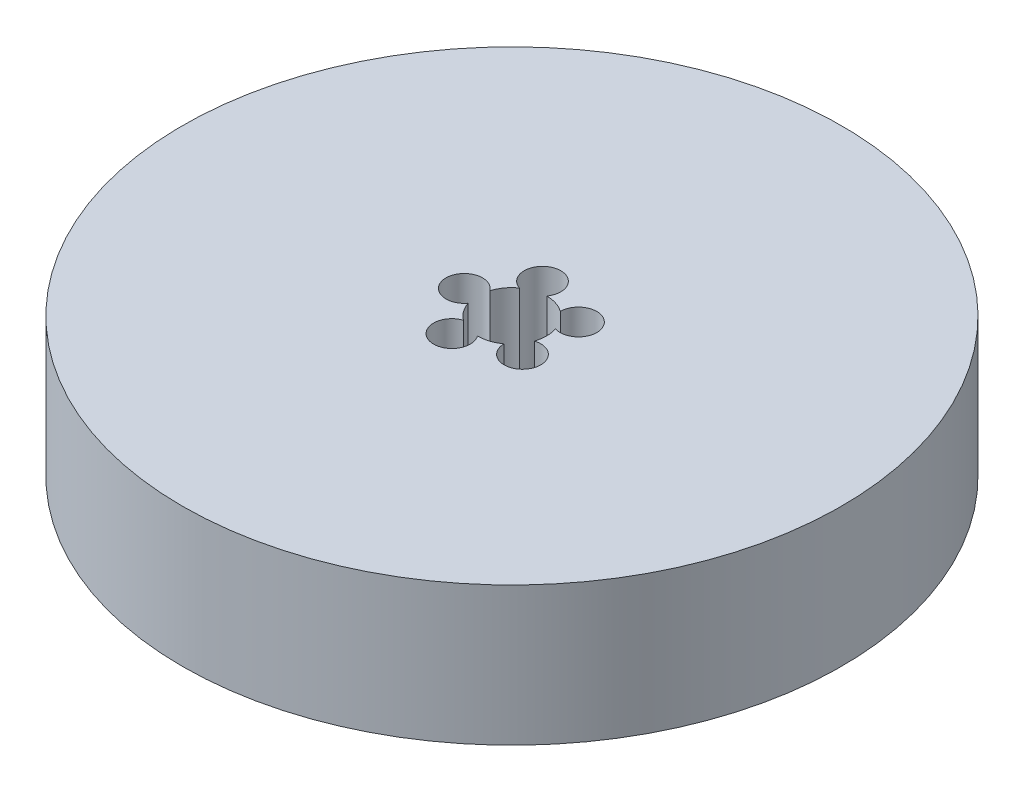
ISO-10303-21;
HEADER;
FILE_DESCRIPTION(('STEP AP214'),'2;1');
FILE_NAME('part.step','',(''),(''),'','','');
FILE_SCHEMA(('AUTOMOTIVE_DESIGN { 1 0 10303 214 1 1 1 1 }'));
ENDSEC;
DATA;
#1=APPLICATION_CONTEXT('core data for automotive mechanical design processes');
#2=APPLICATION_PROTOCOL_DEFINITION('international standard','automotive_design',2000,#1);
#3=PRODUCT_CONTEXT('',#1,'mechanical');
#4=PRODUCT('Part','Part','',(#3));
#5=PRODUCT_RELATED_PRODUCT_CATEGORY('part','',(#4));
#6=PRODUCT_DEFINITION_FORMATION('','',#4);
#7=PRODUCT_DEFINITION_CONTEXT('part definition',#1,'design');
#8=PRODUCT_DEFINITION('design','',#6,#7);
#9=PRODUCT_DEFINITION_SHAPE('','',#8);
#10=(LENGTH_UNIT() NAMED_UNIT(*) SI_UNIT(.MILLI.,.METRE.));
#11=(NAMED_UNIT(*) PLANE_ANGLE_UNIT() SI_UNIT($,.RADIAN.));
#12=(NAMED_UNIT(*) SI_UNIT($,.STERADIAN.) SOLID_ANGLE_UNIT());
#13=UNCERTAINTY_MEASURE_WITH_UNIT(LENGTH_MEASURE(1.E-05),#10,'distance_accuracy_value','');
#14=(GEOMETRIC_REPRESENTATION_CONTEXT(3) GLOBAL_UNCERTAINTY_ASSIGNED_CONTEXT((#13)) GLOBAL_UNIT_ASSIGNED_CONTEXT((#10,
#11,#12)) REPRESENTATION_CONTEXT('',''));
#15=CARTESIAN_POINT('',(0.,0.,0.));
#16=DIRECTION('',(0.,0.,1.));
#17=DIRECTION('',(1.,0.,0.));
#18=AXIS2_PLACEMENT_3D('',#15,#16,#17);
#19=CARTESIAN_POINT('',(0.,20.,0.));
#20=DIRECTION('',(0.,-1.,0.));
#21=DIRECTION('',(0.,0.,-1.));
#22=AXIS2_PLACEMENT_3D('',#19,#20,#21);
#23=CYLINDRICAL_SURFACE('',#22,47.5);
#24=CARTESIAN_POINT('',(0.,20.,0.));
#25=DIRECTION('',(0.,1.,0.));
#26=DIRECTION('',(0.,0.,1.));
#27=AXIS2_PLACEMENT_3D('',#24,#25,#26);
#28=CIRCLE('',#27,47.5);
#29=CARTESIAN_POINT('',(0.,20.,47.5));
#30=VERTEX_POINT('',#29);
#31=EDGE_CURVE('E157',#30,#30,#28,.T.);
#32=ORIENTED_EDGE('',*,*,#31,.F.);
#33=EDGE_LOOP('',(#32));
#34=FACE_BOUND('',#33,.T.);
#35=CARTESIAN_POINT('',(0.,0.,0.));
#36=DIRECTION('',(0.,1.,0.));
#37=DIRECTION('',(0.,0.,1.));
#38=AXIS2_PLACEMENT_3D('',#35,#36,#37);
#39=CIRCLE('',#38,47.5);
#40=CARTESIAN_POINT('',(0.,0.,47.5));
#41=VERTEX_POINT('',#40);
#42=EDGE_CURVE('E150',#41,#41,#39,.T.);
#43=ORIENTED_EDGE('',*,*,#42,.T.);
#44=EDGE_LOOP('',(#43));
#45=FACE_BOUND('',#44,.T.);
#46=ADVANCED_FACE('F39',(#34,#45),#23,.T.);
#47=CARTESIAN_POINT('',(0.,20.,0.));
#48=DIRECTION('',(0.,1.,0.));
#49=DIRECTION('',(0.,0.,1.));
#50=AXIS2_PLACEMENT_3D('',#47,#48,#49);
#51=PLANE('',#50);
#52=CARTESIAN_POINT('',(-2.12147698587407,20.,-6.52923479392056));
#53=DIRECTION('',(0.,1.,0.));
#54=DIRECTION('',(-0.95105651629515,0.,0.309016994374958));
#55=AXIS2_PLACEMENT_3D('',#52,#53,#54);
#56=CIRCLE('',#55,2.63897074803025);
#57=CARTESIAN_POINT('',(0.0291850133280784,20.,-4.99991482277419));
#58=VERTEX_POINT('',#57);
#59=CARTESIAN_POINT('',(-2.96248736730877,20.,-4.02786154162925));
#60=VERTEX_POINT('',#59);
#61=EDGE_CURVE('E194',#58,#60,#56,.T.);
#62=ORIENTED_EDGE('',*,*,#61,.F.);
#63=CARTESIAN_POINT('',(0.,20.,0.));
#64=DIRECTION('',(0.,1.,0.));
#65=DIRECTION('',(0.,0.,1.));
#66=AXIS2_PLACEMENT_3D('',#63,#64,#65);
#67=CIRCLE('',#66,5.);
#68=CARTESIAN_POINT('',(2.91526502378165,20.,-4.06217058247378));
#69=VERTEX_POINT('',#68);
#70=EDGE_CURVE('E147',#69,#58,#67,.T.);
#71=ORIENTED_EDGE('',*,*,#70,.F.);
#72=CARTESIAN_POINT('',(5.55409885536877,20.,-4.03528902317138));
#73=DIRECTION('',(0.,1.,0.));
#74=DIRECTION('',(-0.58778525229248,0.,-0.809016994374942));
#75=AXIS2_PLACEMENT_3D('',#72,#73,#74);
#76=CIRCLE('',#75,2.63897074803025);
#77=CARTESIAN_POINT('',(4.76422023821956,20.,-1.51730205356059));
#78=VERTEX_POINT('',#77);
#79=EDGE_CURVE('E254',#78,#69,#76,.T.);
#80=ORIENTED_EDGE('',*,*,#79,.F.);
#81=CARTESIAN_POINT('',(4.76422023821958,20.,1.51730205356052));
#82=VERTEX_POINT('',#81);
#83=EDGE_CURVE('E144',#82,#78,#67,.T.);
#84=ORIENTED_EDGE('',*,*,#83,.F.);
#85=CARTESIAN_POINT('',(5.55409885536883,20.,4.0352890231713));
#86=DIRECTION('',(0.,1.,0.));
#87=DIRECTION('',(0.587785252292469,0.,-0.809016994374951));
#88=AXIS2_PLACEMENT_3D('',#85,#86,#87);
#89=CIRCLE('',#88,2.63897074803025);
#90=CARTESIAN_POINT('',(2.9152650237817,20.,4.06217058247374));
#91=VERTEX_POINT('',#90);
#92=EDGE_CURVE('E141',#91,#82,#89,.T.);
#93=ORIENTED_EDGE('',*,*,#92,.F.);
#94=CARTESIAN_POINT('',(0.0291850133281478,20.,4.99991482277419));
#95=VERTEX_POINT('',#94);
#96=EDGE_CURVE('E134',#95,#91,#67,.T.);
#97=ORIENTED_EDGE('',*,*,#96,.F.);
#98=CARTESIAN_POINT('',(-2.12147698587398,20.,6.52923479392059));
#99=DIRECTION('',(0.,1.,0.));
#100=DIRECTION('',(0.951056516295155,0.,0.309016994374945));
#101=AXIS2_PLACEMENT_3D('',#98,#99,#100);
#102=CIRCLE('',#101,2.63897074803025);
#103=CARTESIAN_POINT('',(-2.96248736730871,20.,4.02786154162929));
#104=VERTEX_POINT('',#103);
#105=EDGE_CURVE('E111',#104,#95,#102,.T.);
#106=ORIENTED_EDGE('',*,*,#105,.F.);
#107=CARTESIAN_POINT('',(-4.74618290802067,20.,1.57281524776831));
#108=VERTEX_POINT('',#107);
#109=EDGE_CURVE('E145',#108,#104,#67,.T.);
#110=ORIENTED_EDGE('',*,*,#109,.F.);
#111=CARTESIAN_POINT('',(-6.86524373898962,20.,0.));
#112=DIRECTION('',(0.,1.,0.));
#113=DIRECTION('',(0.,0.,1.));
#114=AXIS2_PLACEMENT_3D('',#111,#112,#113);
#115=CIRCLE('',#114,2.63897074803025);
#116=CARTESIAN_POINT('',(-4.74618290802067,20.,-1.57281524776831));
#117=VERTEX_POINT('',#116);
#118=EDGE_CURVE('E153',#117,#108,#115,.T.);
#119=ORIENTED_EDGE('',*,*,#118,.F.);
#120=EDGE_CURVE('E146',#60,#117,#67,.T.);
#121=ORIENTED_EDGE('',*,*,#120,.F.);
#122=EDGE_LOOP('',(#62,#71,#80,#84,#93,#97,#106,#110,#119,#121));
#123=FACE_BOUND('',#122,.T.);
#124=ORIENTED_EDGE('',*,*,#31,.T.);
#125=EDGE_LOOP('',(#124));
#126=FACE_BOUND('',#125,.T.);
#127=ADVANCED_FACE('F139',(#123,#126),#51,.T.);
#128=CARTESIAN_POINT('',(0.,0.,0.));
#129=DIRECTION('',(0.,1.,0.));
#130=DIRECTION('',(0.,0.,1.));
#131=AXIS2_PLACEMENT_3D('',#128,#129,#130);
#132=PLANE('',#131);
#133=CARTESIAN_POINT('',(0.,0.,0.));
#134=DIRECTION('',(0.,1.,0.));
#135=DIRECTION('',(0.,0.,1.));
#136=AXIS2_PLACEMENT_3D('',#133,#134,#135);
#137=CIRCLE('',#136,5.);
#138=CARTESIAN_POINT('',(0.,0.,5.));
#139=VERTEX_POINT('',#138);
#140=EDGE_CURVE('E154',#139,#139,#137,.T.);
#141=ORIENTED_EDGE('',*,*,#140,.T.);
#142=EDGE_LOOP('',(#141));
#143=FACE_BOUND('',#142,.T.);
#144=ORIENTED_EDGE('',*,*,#42,.F.);
#145=EDGE_LOOP('',(#144));
#146=FACE_BOUND('',#145,.T.);
#147=ADVANCED_FACE('F213',(#143,#146),#132,.F.);
#148=CARTESIAN_POINT('',(0.,20.,0.));
#149=DIRECTION('',(0.,-1.,0.));
#150=DIRECTION('',(0.,0.,-1.));
#151=AXIS2_PLACEMENT_3D('',#148,#149,#150);
#152=CYLINDRICAL_SURFACE('',#151,5.);
#153=DIRECTION('',(0.,1.,0.));
#154=VECTOR('',#153,1.);
#155=CARTESIAN_POINT('',(0.0291850133280779,12.1211889570614,-4.99991482277419));
#156=LINE('',#155,#154);
#157=CARTESIAN_POINT('',(0.0291850133280784,4.24237791412272,-4.99991482277419));
#158=VERTEX_POINT('',#157);
#159=EDGE_CURVE('E11',#158,#58,#156,.T.);
#160=ORIENTED_EDGE('',*,*,#159,.F.);
#161=CARTESIAN_POINT('',(0.,4.24237791412272,0.));
#162=DIRECTION('',(0.,1.,0.));
#163=DIRECTION('',(0.,0.,1.));
#164=AXIS2_PLACEMENT_3D('',#161,#162,#163);
#165=CIRCLE('',#164,5.);
#166=CARTESIAN_POINT('',(-2.96248736730877,4.24237791412272,-4.02786154162925));
#167=VERTEX_POINT('',#166);
#168=EDGE_CURVE('E189',#158,#167,#165,.T.);
#169=ORIENTED_EDGE('',*,*,#168,.T.);
#170=DIRECTION('',(0.,1.,0.));
#171=VECTOR('',#170,1.);
#172=CARTESIAN_POINT('',(-2.96248736730877,12.1211889570614,-4.02786154162925));
#173=LINE('',#172,#171);
#174=EDGE_CURVE('E46',#60,#167,#173,.F.);
#175=ORIENTED_EDGE('',*,*,#174,.F.);
#176=ORIENTED_EDGE('',*,*,#120,.T.);
#177=DIRECTION('',(0.,1.,0.));
#178=VECTOR('',#177,1.);
#179=CARTESIAN_POINT('',(-4.74618290802067,12.1211889570614,-1.57281524776831));
#180=LINE('',#179,#178);
#181=CARTESIAN_POINT('',(-4.74618290802067,4.24237791412272,-1.57281524776831));
#182=VERTEX_POINT('',#181);
#183=EDGE_CURVE('E168',#182,#117,#180,.T.);
#184=ORIENTED_EDGE('',*,*,#183,.F.);
#185=CARTESIAN_POINT('',(0.,4.24237791412272,0.));
#186=DIRECTION('',(0.,1.,0.));
#187=DIRECTION('',(0.,0.,1.));
#188=AXIS2_PLACEMENT_3D('',#185,#186,#187);
#189=CIRCLE('',#188,5.);
#190=CARTESIAN_POINT('',(-4.74618290802067,4.24237791412272,1.57281524776831));
#191=VERTEX_POINT('',#190);
#192=EDGE_CURVE('E165',#182,#191,#189,.T.);
#193=ORIENTED_EDGE('',*,*,#192,.T.);
#194=DIRECTION('',(0.,1.,0.));
#195=VECTOR('',#194,1.);
#196=CARTESIAN_POINT('',(-4.74618290802067,12.1211889570614,1.57281524776831));
#197=LINE('',#196,#195);
#198=EDGE_CURVE('E170',#108,#191,#197,.F.);
#199=ORIENTED_EDGE('',*,*,#198,.F.);
#200=ORIENTED_EDGE('',*,*,#109,.T.);
#201=DIRECTION('',(0.,1.,0.));
#202=VECTOR('',#201,1.);
#203=CARTESIAN_POINT('',(-2.96248736730871,12.1211889570614,4.02786154162929));
#204=LINE('',#203,#202);
#205=CARTESIAN_POINT('',(-2.96248736730871,4.24237791412272,4.02786154162929));
#206=VERTEX_POINT('',#205);
#207=EDGE_CURVE('E121',#206,#104,#204,.T.);
#208=ORIENTED_EDGE('',*,*,#207,.F.);
#209=CARTESIAN_POINT('',(0.,4.24237791412272,0.));
#210=DIRECTION('',(0.,1.,0.));
#211=DIRECTION('',(0.,0.,1.));
#212=AXIS2_PLACEMENT_3D('',#209,#210,#211);
#213=CIRCLE('',#212,5.);
#214=CARTESIAN_POINT('',(0.0291850133281478,4.24237791412272,4.99991482277419));
#215=VERTEX_POINT('',#214);
#216=EDGE_CURVE('E136',#206,#215,#213,.T.);
#217=ORIENTED_EDGE('',*,*,#216,.T.);
#218=DIRECTION('',(0.,1.,0.));
#219=VECTOR('',#218,1.);
#220=CARTESIAN_POINT('',(0.0291850133281469,12.1211889570614,4.99991482277419));
#221=LINE('',#220,#219);
#222=EDGE_CURVE('E117',#95,#215,#221,.F.);
#223=ORIENTED_EDGE('',*,*,#222,.F.);
#224=ORIENTED_EDGE('',*,*,#96,.T.);
#225=DIRECTION('',(0.,1.,0.));
#226=VECTOR('',#225,1.);
#227=CARTESIAN_POINT('',(2.9152650237817,12.1211889570614,4.06217058247374));
#228=LINE('',#227,#226);
#229=CARTESIAN_POINT('',(2.9152650237817,4.24237791412272,4.06217058247374));
#230=VERTEX_POINT('',#229);
#231=EDGE_CURVE('E182',#230,#91,#228,.T.);
#232=ORIENTED_EDGE('',*,*,#231,.F.);
#233=CARTESIAN_POINT('',(0.,4.24237791412272,0.));
#234=DIRECTION('',(0.,1.,0.));
#235=DIRECTION('',(0.,0.,1.));
#236=AXIS2_PLACEMENT_3D('',#233,#234,#235);
#237=CIRCLE('',#236,5.);
#238=CARTESIAN_POINT('',(4.76422023821958,4.24237791412272,1.51730205356052));
#239=VERTEX_POINT('',#238);
#240=EDGE_CURVE('E174',#230,#239,#237,.T.);
#241=ORIENTED_EDGE('',*,*,#240,.T.);
#242=DIRECTION('',(0.,1.,0.));
#243=VECTOR('',#242,1.);
#244=CARTESIAN_POINT('',(4.76422023821958,12.1211889570614,1.51730205356052));
#245=LINE('',#244,#243);
#246=EDGE_CURVE('E177',#82,#239,#245,.F.);
#247=ORIENTED_EDGE('',*,*,#246,.F.);
#248=ORIENTED_EDGE('',*,*,#83,.T.);
#249=DIRECTION('',(0.,1.,0.));
#250=VECTOR('',#249,1.);
#251=CARTESIAN_POINT('',(4.76422023821956,12.1211889570614,-1.51730205356059));
#252=LINE('',#251,#250);
#253=CARTESIAN_POINT('',(4.76422023821956,4.24237791412272,-1.51730205356059));
#254=VERTEX_POINT('',#253);
#255=EDGE_CURVE('E187',#254,#78,#252,.T.);
#256=ORIENTED_EDGE('',*,*,#255,.F.);
#257=CARTESIAN_POINT('',(0.,4.24237791412272,0.));
#258=DIRECTION('',(0.,1.,0.));
#259=DIRECTION('',(0.,0.,1.));
#260=AXIS2_PLACEMENT_3D('',#257,#258,#259);
#261=CIRCLE('',#260,5.);
#262=CARTESIAN_POINT('',(2.91526502378165,4.24237791412272,-4.06217058247378));
#263=VERTEX_POINT('',#262);
#264=EDGE_CURVE('E181',#254,#263,#261,.T.);
#265=ORIENTED_EDGE('',*,*,#264,.T.);
#266=DIRECTION('',(0.,1.,0.));
#267=VECTOR('',#266,1.);
#268=CARTESIAN_POINT('',(2.91526502378165,12.1211889570614,-4.06217058247378));
#269=LINE('',#268,#267);
#270=EDGE_CURVE('E186',#69,#263,#269,.F.);
#271=ORIENTED_EDGE('',*,*,#270,.F.);
#272=ORIENTED_EDGE('',*,*,#70,.T.);
#273=EDGE_LOOP('',(#160,#169,#175,#176,#184,#193,#199,#200,#208,#217,#223,#224,#232,#241,#247,
#248,#256,#265,#271,#272));
#274=FACE_BOUND('',#273,.T.);
#275=ORIENTED_EDGE('',*,*,#140,.F.);
#276=EDGE_LOOP('',(#275));
#277=FACE_BOUND('',#276,.T.);
#278=ADVANCED_FACE('F135',(#274,#277),#152,.F.);
#279=CARTESIAN_POINT('',(-6.86524373898962,4.24237791412272,0.));
#280=DIRECTION('',(0.,1.,0.));
#281=DIRECTION('',(0.,0.,1.));
#282=AXIS2_PLACEMENT_3D('',#279,#280,#281);
#283=CYLINDRICAL_SURFACE('',#282,2.63897074803025);
#284=ORIENTED_EDGE('',*,*,#183,.T.);
#285=ORIENTED_EDGE('',*,*,#118,.T.);
#286=ORIENTED_EDGE('',*,*,#198,.T.);
#287=CARTESIAN_POINT('',(-6.86524373898962,4.24237791412272,0.));
#288=DIRECTION('',(0.,1.,0.));
#289=DIRECTION('',(0.,0.,1.));
#290=AXIS2_PLACEMENT_3D('',#287,#288,#289);
#291=CIRCLE('',#290,2.63897074803025);
#292=EDGE_CURVE('E158',#182,#191,#291,.T.);
#293=ORIENTED_EDGE('',*,*,#292,.F.);
#294=EDGE_LOOP('',(#284,#285,#286,#293));
#295=FACE_BOUND('',#294,.T.);
#296=ADVANCED_FACE('F221',(#295),#283,.F.);
#297=CARTESIAN_POINT('',(-6.86524373898962,4.24237791412272,0.));
#298=DIRECTION('',(0.,1.,0.));
#299=DIRECTION('',(0.,0.,1.));
#300=AXIS2_PLACEMENT_3D('',#297,#298,#299);
#301=PLANE('',#300);
#302=ORIENTED_EDGE('',*,*,#292,.T.);
#303=ORIENTED_EDGE('',*,*,#192,.F.);
#304=EDGE_LOOP('',(#302,#303));
#305=FACE_BOUND('',#304,.T.);
#306=ADVANCED_FACE('F227',(#305),#301,.T.);
#307=CARTESIAN_POINT('',(-2.12147698587398,4.24237791412272,6.52923479392059));
#308=DIRECTION('',(0.,1.,0.));
#309=DIRECTION('',(0.,0.,1.));
#310=AXIS2_PLACEMENT_3D('',#307,#308,#309);
#311=CYLINDRICAL_SURFACE('',#310,2.63897074803025);
#312=ORIENTED_EDGE('',*,*,#207,.T.);
#313=ORIENTED_EDGE('',*,*,#105,.T.);
#314=ORIENTED_EDGE('',*,*,#222,.T.);
#315=CARTESIAN_POINT('',(-2.12147698587398,4.24237791412272,6.52923479392059));
#316=DIRECTION('',(0.,1.,0.));
#317=DIRECTION('',(0.951056516295155,0.,0.309016994374945));
#318=AXIS2_PLACEMENT_3D('',#315,#316,#317);
#319=CIRCLE('',#318,2.63897074803025);
#320=EDGE_CURVE('E127',#206,#215,#319,.T.);
#321=ORIENTED_EDGE('',*,*,#320,.F.);
#322=EDGE_LOOP('',(#312,#313,#314,#321));
#323=FACE_BOUND('',#322,.T.);
#324=ADVANCED_FACE('F116',(#323),#311,.F.);
#325=CARTESIAN_POINT('',(-2.12147698587398,4.24237791412272,6.52923479392059));
#326=DIRECTION('',(0.,1.,0.));
#327=DIRECTION('',(0.951056516295155,0.,0.309016994374945));
#328=AXIS2_PLACEMENT_3D('',#325,#326,#327);
#329=PLANE('',#328);
#330=ORIENTED_EDGE('',*,*,#320,.T.);
#331=ORIENTED_EDGE('',*,*,#216,.F.);
#332=EDGE_LOOP('',(#330,#331));
#333=FACE_BOUND('',#332,.T.);
#334=ADVANCED_FACE('F234',(#333),#329,.T.);
#335=CARTESIAN_POINT('',(5.55409885536883,4.24237791412272,4.0352890231713));
#336=DIRECTION('',(0.,1.,0.));
#337=DIRECTION('',(0.,0.,1.));
#338=AXIS2_PLACEMENT_3D('',#335,#336,#337);
#339=CYLINDRICAL_SURFACE('',#338,2.63897074803025);
#340=ORIENTED_EDGE('',*,*,#231,.T.);
#341=ORIENTED_EDGE('',*,*,#92,.T.);
#342=ORIENTED_EDGE('',*,*,#246,.T.);
#343=CARTESIAN_POINT('',(5.55409885536883,4.24237791412272,4.0352890231713));
#344=DIRECTION('',(0.,1.,0.));
#345=DIRECTION('',(0.587785252292469,0.,-0.809016994374951));
#346=AXIS2_PLACEMENT_3D('',#343,#344,#345);
#347=CIRCLE('',#346,2.63897074803025);
#348=EDGE_CURVE('E130',#230,#239,#347,.T.);
#349=ORIENTED_EDGE('',*,*,#348,.F.);
#350=EDGE_LOOP('',(#340,#341,#342,#349));
#351=FACE_BOUND('',#350,.T.);
#352=ADVANCED_FACE('F240',(#351),#339,.F.);
#353=CARTESIAN_POINT('',(5.55409885536883,4.24237791412272,4.0352890231713));
#354=DIRECTION('',(0.,1.,0.));
#355=DIRECTION('',(0.587785252292469,0.,-0.809016994374951));
#356=AXIS2_PLACEMENT_3D('',#353,#354,#355);
#357=PLANE('',#356);
#358=ORIENTED_EDGE('',*,*,#348,.T.);
#359=ORIENTED_EDGE('',*,*,#240,.F.);
#360=EDGE_LOOP('',(#358,#359));
#361=FACE_BOUND('',#360,.T.);
#362=ADVANCED_FACE('F245',(#361),#357,.T.);
#363=CARTESIAN_POINT('',(5.55409885536877,4.24237791412272,-4.03528902317138));
#364=DIRECTION('',(0.,1.,0.));
#365=DIRECTION('',(0.,0.,1.));
#366=AXIS2_PLACEMENT_3D('',#363,#364,#365);
#367=CYLINDRICAL_SURFACE('',#366,2.63897074803025);
#368=ORIENTED_EDGE('',*,*,#255,.T.);
#369=ORIENTED_EDGE('',*,*,#79,.T.);
#370=ORIENTED_EDGE('',*,*,#270,.T.);
#371=CARTESIAN_POINT('',(5.55409885536877,4.24237791412272,-4.03528902317138));
#372=DIRECTION('',(0.,1.,0.));
#373=DIRECTION('',(-0.58778525229248,0.,-0.809016994374942));
#374=AXIS2_PLACEMENT_3D('',#371,#372,#373);
#375=CIRCLE('',#374,2.63897074803025);
#376=EDGE_CURVE('E56',#254,#263,#375,.T.);
#377=ORIENTED_EDGE('',*,*,#376,.F.);
#378=EDGE_LOOP('',(#368,#369,#370,#377));
#379=FACE_BOUND('',#378,.T.);
#380=ADVANCED_FACE('F266',(#379),#367,.F.);
#381=CARTESIAN_POINT('',(5.55409885536877,4.24237791412272,-4.03528902317138));
#382=DIRECTION('',(0.,1.,0.));
#383=DIRECTION('',(-0.58778525229248,0.,-0.809016994374942));
#384=AXIS2_PLACEMENT_3D('',#381,#382,#383);
#385=PLANE('',#384);
#386=ORIENTED_EDGE('',*,*,#376,.T.);
#387=ORIENTED_EDGE('',*,*,#264,.F.);
#388=EDGE_LOOP('',(#386,#387));
#389=FACE_BOUND('',#388,.T.);
#390=ADVANCED_FACE('F204',(#389),#385,.T.);
#391=CARTESIAN_POINT('',(-2.12147698587407,4.24237791412272,-6.52923479392056));
#392=DIRECTION('',(0.,1.,0.));
#393=DIRECTION('',(0.,0.,1.));
#394=AXIS2_PLACEMENT_3D('',#391,#392,#393);
#395=CYLINDRICAL_SURFACE('',#394,2.63897074803025);
#396=ORIENTED_EDGE('',*,*,#159,.T.);
#397=ORIENTED_EDGE('',*,*,#61,.T.);
#398=ORIENTED_EDGE('',*,*,#174,.T.);
#399=CARTESIAN_POINT('',(-2.12147698587407,4.24237791412272,-6.52923479392056));
#400=DIRECTION('',(0.,1.,0.));
#401=DIRECTION('',(-0.95105651629515,0.,0.309016994374958));
#402=AXIS2_PLACEMENT_3D('',#399,#400,#401);
#403=CIRCLE('',#402,2.63897074803025);
#404=EDGE_CURVE('E55',#158,#167,#403,.T.);
#405=ORIENTED_EDGE('',*,*,#404,.F.);
#406=EDGE_LOOP('',(#396,#397,#398,#405));
#407=FACE_BOUND('',#406,.T.);
#408=ADVANCED_FACE('F193',(#407),#395,.F.);
#409=CARTESIAN_POINT('',(-2.12147698587407,4.24237791412272,-6.52923479392056));
#410=DIRECTION('',(0.,1.,0.));
#411=DIRECTION('',(-0.95105651629515,0.,0.309016994374958));
#412=AXIS2_PLACEMENT_3D('',#409,#410,#411);
#413=PLANE('',#412);
#414=ORIENTED_EDGE('',*,*,#404,.T.);
#415=ORIENTED_EDGE('',*,*,#168,.F.);
#416=EDGE_LOOP('',(#414,#415));
#417=FACE_BOUND('',#416,.T.);
#418=ADVANCED_FACE('F196',(#417),#413,.T.);
#419=CLOSED_SHELL('',(#46,#127,#147,#278,#296,#306,#324,#334,#352,#362,#380,#390,#408,#418));
#420=MANIFOLD_SOLID_BREP('B2',#419);
#421=ADVANCED_BREP_SHAPE_REPRESENTATION('',(#18,#420),#14);
#422=SHAPE_DEFINITION_REPRESENTATION(#9,#421);
ENDSEC;
END-ISO-10303-21;
